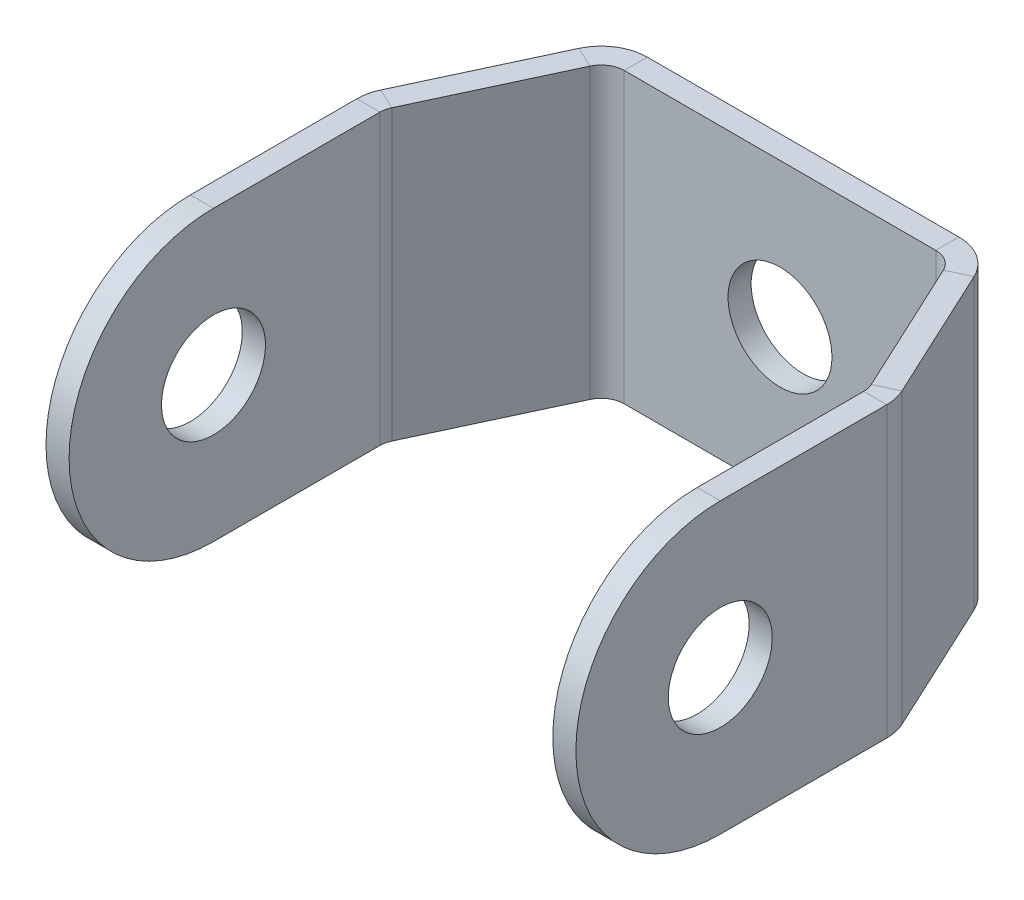
ISO-10303-21;
HEADER;
FILE_DESCRIPTION(('STEP AP214'),'2;1');
FILE_NAME('part.step','',(''),(''),'','','');
FILE_SCHEMA(('AUTOMOTIVE_DESIGN { 1 0 10303 214 1 1 1 1 }'));
ENDSEC;
DATA;
#1=APPLICATION_CONTEXT('core data for automotive mechanical design processes');
#2=APPLICATION_PROTOCOL_DEFINITION('international standard','automotive_design',2000,#1);
#3=PRODUCT_CONTEXT('',#1,'mechanical');
#4=PRODUCT('Part','Part','',(#3));
#5=PRODUCT_RELATED_PRODUCT_CATEGORY('part','',(#4));
#6=PRODUCT_DEFINITION_FORMATION('','',#4);
#7=PRODUCT_DEFINITION_CONTEXT('part definition',#1,'design');
#8=PRODUCT_DEFINITION('design','',#6,#7);
#9=PRODUCT_DEFINITION_SHAPE('','',#8);
#10=(LENGTH_UNIT() NAMED_UNIT(*) SI_UNIT(.MILLI.,.METRE.));
#11=(NAMED_UNIT(*) PLANE_ANGLE_UNIT() SI_UNIT($,.RADIAN.));
#12=(NAMED_UNIT(*) SI_UNIT($,.STERADIAN.) SOLID_ANGLE_UNIT());
#13=UNCERTAINTY_MEASURE_WITH_UNIT(LENGTH_MEASURE(1.E-05),#10,'distance_accuracy_value','');
#14=(GEOMETRIC_REPRESENTATION_CONTEXT(3) GLOBAL_UNCERTAINTY_ASSIGNED_CONTEXT((#13)) GLOBAL_UNIT_ASSIGNED_CONTEXT((#10,
#11,#12)) REPRESENTATION_CONTEXT('',''));
#15=CARTESIAN_POINT('',(0.,0.,0.));
#16=DIRECTION('',(0.,0.,1.));
#17=DIRECTION('',(1.,0.,0.));
#18=AXIS2_PLACEMENT_3D('',#15,#16,#17);
#19=CARTESIAN_POINT('',(-20.9421250605527,0.,30.1152937835399));
#20=DIRECTION('',(-1.,0.,0.));
#21=DIRECTION('',(0.,0.,1.));
#22=AXIS2_PLACEMENT_3D('',#19,#20,#21);
#23=CYLINDRICAL_SURFACE('',#22,12.5);
#24=CARTESIAN_POINT('',(-22.9421250605527,0.,30.1152937835399));
#25=DIRECTION('',(1.,0.,0.));
#26=DIRECTION('',(0.,0.,-1.));
#27=AXIS2_PLACEMENT_3D('',#24,#25,#26);
#28=CIRCLE('',#27,12.5);
#29=CARTESIAN_POINT('',(-22.9421250605527,12.5,30.1152937835399));
#30=VERTEX_POINT('',#29);
#31=CARTESIAN_POINT('',(-22.9421250605527,-12.5,30.1152937835399));
#32=VERTEX_POINT('',#31);
#33=EDGE_CURVE('E76',#30,#32,#28,.T.);
#34=ORIENTED_EDGE('',*,*,#33,.T.);
#35=DIRECTION('',(-1.,0.,0.));
#36=VECTOR('',#35,1.);
#37=CARTESIAN_POINT('',(-20.9421250605527,-12.5,30.1152937835399));
#38=LINE('',#37,#36);
#39=CARTESIAN_POINT('',(-20.9421250605527,-12.5,30.1152937835399));
#40=VERTEX_POINT('',#39);
#41=EDGE_CURVE('E288',#40,#32,#38,.T.);
#42=ORIENTED_EDGE('',*,*,#41,.F.);
#43=CARTESIAN_POINT('',(-20.9421250605527,0.,30.1152937835399));
#44=DIRECTION('',(1.,0.,0.));
#45=DIRECTION('',(0.,0.,-1.));
#46=AXIS2_PLACEMENT_3D('',#43,#44,#45);
#47=CIRCLE('',#46,12.5);
#48=CARTESIAN_POINT('',(-20.9421250605527,12.5,30.1152937835399));
#49=VERTEX_POINT('',#48);
#50=EDGE_CURVE('E282',#49,#40,#47,.T.);
#51=ORIENTED_EDGE('',*,*,#50,.F.);
#52=DIRECTION('',(-1.,0.,0.));
#53=VECTOR('',#52,1.);
#54=CARTESIAN_POINT('',(-20.9421250605527,12.5,30.1152937835399));
#55=LINE('',#54,#53);
#56=EDGE_CURVE('E297',#49,#30,#55,.T.);
#57=ORIENTED_EDGE('',*,*,#56,.T.);
#58=EDGE_LOOP('',(#34,#42,#51,#57));
#59=FACE_BOUND('',#58,.T.);
#60=ADVANCED_FACE('F39',(#59),#23,.T.);
#61=CARTESIAN_POINT('',(-20.9421250605527,0.,30.1152937835399));
#62=DIRECTION('',(-1.,0.,0.));
#63=DIRECTION('',(0.,0.,1.));
#64=AXIS2_PLACEMENT_3D('',#61,#62,#63);
#65=CYLINDRICAL_SURFACE('',#64,4.5);
#66=CARTESIAN_POINT('',(-20.9421250605527,0.,30.1152937835399));
#67=DIRECTION('',(1.,0.,0.));
#68=DIRECTION('',(0.,0.,1.));
#69=AXIS2_PLACEMENT_3D('',#66,#67,#68);
#70=CIRCLE('',#69,4.5);
#71=CARTESIAN_POINT('',(-20.9421250605527,0.,34.6152937835399));
#72=VERTEX_POINT('',#71);
#73=EDGE_CURVE('E294',#72,#72,#70,.T.);
#74=ORIENTED_EDGE('',*,*,#73,.T.);
#75=EDGE_LOOP('',(#74));
#76=FACE_BOUND('',#75,.T.);
#77=CARTESIAN_POINT('',(-22.9421250605527,0.,30.1152937835399));
#78=DIRECTION('',(1.,0.,0.));
#79=DIRECTION('',(0.,0.,1.));
#80=AXIS2_PLACEMENT_3D('',#77,#78,#79);
#81=CIRCLE('',#80,4.5);
#82=CARTESIAN_POINT('',(-22.9421250605527,0.,34.6152937835399));
#83=VERTEX_POINT('',#82);
#84=EDGE_CURVE('E291',#83,#83,#81,.T.);
#85=ORIENTED_EDGE('',*,*,#84,.F.);
#86=EDGE_LOOP('',(#85));
#87=FACE_BOUND('',#86,.T.);
#88=ADVANCED_FACE('F493',(#76,#87),#65,.F.);
#89=CARTESIAN_POINT('',(-22.942125060553,0.,-59.8847062164601));
#90=DIRECTION('',(-1.,0.,0.));
#91=DIRECTION('',(0.,0.,1.));
#92=AXIS2_PLACEMENT_3D('',#89,#90,#91);
#93=PLANE('',#92);
#94=ORIENTED_EDGE('',*,*,#84,.T.);
#95=EDGE_LOOP('',(#94));
#96=FACE_BOUND('',#95,.T.);
#97=DIRECTION('',(0.,0.,1.));
#98=VECTOR('',#97,1.);
#99=CARTESIAN_POINT('',(-22.9421250605527,12.5,30.1152937835399));
#100=LINE('',#99,#98);
#101=CARTESIAN_POINT('',(-22.9421250605527,12.5,15.696924756767));
#102=VERTEX_POINT('',#101);
#103=EDGE_CURVE('E11',#102,#30,#100,.T.);
#104=ORIENTED_EDGE('',*,*,#103,.F.);
#105=DIRECTION('',(0.,-1.,0.));
#106=VECTOR('',#105,1.);
#107=CARTESIAN_POINT('',(-22.9421250605527,0.,15.696924756767));
#108=LINE('',#107,#106);
#109=CARTESIAN_POINT('',(-22.9421250605527,-12.5,15.696924756767));
#110=VERTEX_POINT('',#109);
#111=EDGE_CURVE('E257',#102,#110,#108,.T.);
#112=ORIENTED_EDGE('',*,*,#111,.T.);
#113=DIRECTION('',(0.,0.,-1.));
#114=VECTOR('',#113,1.);
#115=CARTESIAN_POINT('',(-22.9421250605527,-12.5,30.1152937835399));
#116=LINE('',#115,#114);
#117=EDGE_CURVE('E286',#32,#110,#116,.T.);
#118=ORIENTED_EDGE('',*,*,#117,.F.);
#119=ORIENTED_EDGE('',*,*,#33,.F.);
#120=EDGE_LOOP('',(#104,#112,#118,#119));
#121=FACE_BOUND('',#120,.T.);
#122=ADVANCED_FACE('F498',(#96,#121),#93,.T.);
#123=CARTESIAN_POINT('',(-20.9421250605527,-12.5,30.1152937835399));
#124=DIRECTION('',(0.,1.,0.));
#125=DIRECTION('',(1.,0.,0.));
#126=AXIS2_PLACEMENT_3D('',#123,#124,#125);
#127=PLANE('',#126);
#128=DIRECTION('',(-1.,0.,0.));
#129=VECTOR('',#128,1.);
#130=CARTESIAN_POINT('',(-20.9421250605527,-12.5,15.696924756767));
#131=LINE('',#130,#129);
#132=CARTESIAN_POINT('',(-20.9421250605527,-12.5,15.696924756767));
#133=VERTEX_POINT('',#132);
#134=EDGE_CURVE('E300',#133,#110,#131,.T.);
#135=ORIENTED_EDGE('',*,*,#134,.F.);
#136=DIRECTION('',(0.,0.,-1.));
#137=VECTOR('',#136,1.);
#138=CARTESIAN_POINT('',(-20.9421250605527,-12.5,30.1152937835399));
#139=LINE('',#138,#137);
#140=EDGE_CURVE('E49',#40,#133,#139,.T.);
#141=ORIENTED_EDGE('',*,*,#140,.F.);
#142=ORIENTED_EDGE('',*,*,#41,.T.);
#143=ORIENTED_EDGE('',*,*,#117,.T.);
#144=EDGE_LOOP('',(#135,#141,#142,#143));
#145=FACE_BOUND('',#144,.T.);
#146=ADVANCED_FACE('F506',(#145),#127,.F.);
#147=CARTESIAN_POINT('',(-20.942125060553,0.,-59.8847062164601));
#148=DIRECTION('',(-1.,0.,0.));
#149=DIRECTION('',(0.,0.,1.));
#150=AXIS2_PLACEMENT_3D('',#147,#148,#149);
#151=PLANE('',#150);
#152=DIRECTION('',(0.,-1.,0.));
#153=VECTOR('',#152,1.);
#154=CARTESIAN_POINT('',(-20.9421250605527,0.,15.696924756767));
#155=LINE('',#154,#153);
#156=CARTESIAN_POINT('',(-20.9421250605527,12.5,15.696924756767));
#157=VERTEX_POINT('',#156);
#158=EDGE_CURVE('E83',#157,#133,#155,.T.);
#159=ORIENTED_EDGE('',*,*,#158,.F.);
#160=DIRECTION('',(0.,0.,1.));
#161=VECTOR('',#160,1.);
#162=CARTESIAN_POINT('',(-20.9421250605527,12.5,30.1152937835399));
#163=LINE('',#162,#161);
#164=EDGE_CURVE('E284',#157,#49,#163,.T.);
#165=ORIENTED_EDGE('',*,*,#164,.T.);
#166=ORIENTED_EDGE('',*,*,#50,.T.);
#167=ORIENTED_EDGE('',*,*,#140,.T.);
#168=EDGE_LOOP('',(#159,#165,#166,#167));
#169=FACE_BOUND('',#168,.T.);
#170=ORIENTED_EDGE('',*,*,#73,.F.);
#171=EDGE_LOOP('',(#170));
#172=FACE_BOUND('',#171,.T.);
#173=ADVANCED_FACE('F509',(#169,#172),#151,.F.);
#174=CARTESIAN_POINT('',(-20.9421250605527,12.5,30.1152937835399));
#175=DIRECTION('',(0.,-1.,0.));
#176=DIRECTION('',(-1.,0.,0.));
#177=AXIS2_PLACEMENT_3D('',#174,#175,#176);
#178=PLANE('',#177);
#179=DIRECTION('',(1.,0.,0.));
#180=VECTOR('',#179,1.);
#181=CARTESIAN_POINT('',(-20.9421250605527,12.5,15.696924756767));
#182=LINE('',#181,#180);
#183=EDGE_CURVE('E43',#102,#157,#182,.T.);
#184=ORIENTED_EDGE('',*,*,#183,.F.);
#185=ORIENTED_EDGE('',*,*,#103,.T.);
#186=ORIENTED_EDGE('',*,*,#56,.F.);
#187=ORIENTED_EDGE('',*,*,#164,.F.);
#188=EDGE_LOOP('',(#184,#185,#186,#187));
#189=FACE_BOUND('',#188,.T.);
#190=ADVANCED_FACE('F41',(#189),#178,.F.);
#191=CARTESIAN_POINT('',(20.9421250605527,0.,30.1152937835399));
#192=DIRECTION('',(1.,0.,0.));
#193=DIRECTION('',(0.,0.,-1.));
#194=AXIS2_PLACEMENT_3D('',#191,#192,#193);
#195=CYLINDRICAL_SURFACE('',#194,12.5);
#196=CARTESIAN_POINT('',(22.9421250605527,0.,30.1152937835399));
#197=DIRECTION('',(-1.,0.,0.));
#198=DIRECTION('',(0.,0.,-1.));
#199=AXIS2_PLACEMENT_3D('',#196,#197,#198);
#200=CIRCLE('',#199,12.5);
#201=CARTESIAN_POINT('',(22.9421250605527,-12.5,30.1152937835399));
#202=VERTEX_POINT('',#201);
#203=CARTESIAN_POINT('',(22.9421250605527,12.5,30.1152937835399));
#204=VERTEX_POINT('',#203);
#205=EDGE_CURVE('E330',#202,#204,#200,.T.);
#206=ORIENTED_EDGE('',*,*,#205,.T.);
#207=DIRECTION('',(1.,0.,0.));
#208=VECTOR('',#207,1.);
#209=CARTESIAN_POINT('',(20.9421250605527,12.5,30.1152937835399));
#210=LINE('',#209,#208);
#211=CARTESIAN_POINT('',(20.9421250605527,12.5,30.1152937835399));
#212=VERTEX_POINT('',#211);
#213=EDGE_CURVE('E318',#212,#204,#210,.T.);
#214=ORIENTED_EDGE('',*,*,#213,.F.);
#215=CARTESIAN_POINT('',(20.9421250605527,0.,30.1152937835399));
#216=DIRECTION('',(-1.,0.,0.));
#217=DIRECTION('',(0.,0.,-1.));
#218=AXIS2_PLACEMENT_3D('',#215,#216,#217);
#219=CIRCLE('',#218,12.5);
#220=CARTESIAN_POINT('',(20.9421250605527,-12.5,30.1152937835399));
#221=VERTEX_POINT('',#220);
#222=EDGE_CURVE('E307',#221,#212,#219,.T.);
#223=ORIENTED_EDGE('',*,*,#222,.F.);
#224=DIRECTION('',(1.,0.,0.));
#225=VECTOR('',#224,1.);
#226=CARTESIAN_POINT('',(20.9421250605527,-12.5,30.1152937835399));
#227=LINE('',#226,#225);
#228=EDGE_CURVE('E328',#221,#202,#227,.T.);
#229=ORIENTED_EDGE('',*,*,#228,.T.);
#230=EDGE_LOOP('',(#206,#214,#223,#229));
#231=FACE_BOUND('',#230,.T.);
#232=ADVANCED_FACE('F515',(#231),#195,.T.);
#233=CARTESIAN_POINT('',(20.9421250605527,0.,30.1152937835399));
#234=DIRECTION('',(1.,0.,0.));
#235=DIRECTION('',(0.,0.,-1.));
#236=AXIS2_PLACEMENT_3D('',#233,#234,#235);
#237=CYLINDRICAL_SURFACE('',#236,4.5);
#238=CARTESIAN_POINT('',(20.9421250605527,0.,30.1152937835399));
#239=DIRECTION('',(-1.,0.,0.));
#240=DIRECTION('',(0.,0.,1.));
#241=AXIS2_PLACEMENT_3D('',#238,#239,#240);
#242=CIRCLE('',#241,4.5);
#243=CARTESIAN_POINT('',(20.9421250605527,0.,34.6152937835399));
#244=VERTEX_POINT('',#243);
#245=EDGE_CURVE('E325',#244,#244,#242,.T.);
#246=ORIENTED_EDGE('',*,*,#245,.T.);
#247=EDGE_LOOP('',(#246));
#248=FACE_BOUND('',#247,.T.);
#249=CARTESIAN_POINT('',(22.9421250605527,0.,30.1152937835399));
#250=DIRECTION('',(-1.,0.,0.));
#251=DIRECTION('',(0.,0.,1.));
#252=AXIS2_PLACEMENT_3D('',#249,#250,#251);
#253=CIRCLE('',#252,4.5);
#254=CARTESIAN_POINT('',(22.9421250605527,0.,34.6152937835399));
#255=VERTEX_POINT('',#254);
#256=EDGE_CURVE('E322',#255,#255,#253,.T.);
#257=ORIENTED_EDGE('',*,*,#256,.F.);
#258=EDGE_LOOP('',(#257));
#259=FACE_BOUND('',#258,.T.);
#260=ADVANCED_FACE('F554',(#248,#259),#237,.F.);
#261=CARTESIAN_POINT('',(22.9421250605527,0.,30.1152937835399));
#262=DIRECTION('',(1.,0.,0.));
#263=DIRECTION('',(0.,0.,-1.));
#264=AXIS2_PLACEMENT_3D('',#261,#262,#263);
#265=PLANE('',#264);
#266=ORIENTED_EDGE('',*,*,#256,.T.);
#267=EDGE_LOOP('',(#266));
#268=FACE_BOUND('',#267,.T.);
#269=DIRECTION('',(0.,0.,1.));
#270=VECTOR('',#269,1.);
#271=CARTESIAN_POINT('',(22.942125060553,-12.5,-59.8847062164601));
#272=LINE('',#271,#270);
#273=CARTESIAN_POINT('',(22.9421250605527,-12.5,15.696924756767));
#274=VERTEX_POINT('',#273);
#275=EDGE_CURVE('E92',#274,#202,#272,.T.);
#276=ORIENTED_EDGE('',*,*,#275,.F.);
#277=DIRECTION('',(0.,1.,0.));
#278=VECTOR('',#277,1.);
#279=CARTESIAN_POINT('',(22.9421250605527,0.,15.696924756767));
#280=LINE('',#279,#278);
#281=CARTESIAN_POINT('',(22.9421250605527,12.5,15.696924756767));
#282=VERTEX_POINT('',#281);
#283=EDGE_CURVE('E320',#274,#282,#280,.T.);
#284=ORIENTED_EDGE('',*,*,#283,.T.);
#285=DIRECTION('',(0.,0.,-1.));
#286=VECTOR('',#285,1.);
#287=CARTESIAN_POINT('',(22.942125060553,12.5,-59.8847062164601));
#288=LINE('',#287,#286);
#289=EDGE_CURVE('E113',#204,#282,#288,.T.);
#290=ORIENTED_EDGE('',*,*,#289,.F.);
#291=ORIENTED_EDGE('',*,*,#205,.F.);
#292=EDGE_LOOP('',(#276,#284,#290,#291));
#293=FACE_BOUND('',#292,.T.);
#294=ADVANCED_FACE('F550',(#268,#293),#265,.T.);
#295=CARTESIAN_POINT('',(20.942125060553,12.5,-59.8847062164601));
#296=DIRECTION('',(0.,-1.,0.));
#297=DIRECTION('',(1.,0.,0.));
#298=AXIS2_PLACEMENT_3D('',#295,#296,#297);
#299=PLANE('',#298);
#300=DIRECTION('',(1.,0.,0.));
#301=VECTOR('',#300,1.);
#302=CARTESIAN_POINT('',(20.9421250605527,12.5,15.696924756767));
#303=LINE('',#302,#301);
#304=CARTESIAN_POINT('',(20.9421250605527,12.5,15.696924756767));
#305=VERTEX_POINT('',#304);
#306=EDGE_CURVE('E333',#305,#282,#303,.T.);
#307=ORIENTED_EDGE('',*,*,#306,.F.);
#308=DIRECTION('',(0.,0.,-1.));
#309=VECTOR('',#308,1.);
#310=CARTESIAN_POINT('',(20.942125060553,12.5,-59.8847062164601));
#311=LINE('',#310,#309);
#312=EDGE_CURVE('E305',#212,#305,#311,.T.);
#313=ORIENTED_EDGE('',*,*,#312,.F.);
#314=ORIENTED_EDGE('',*,*,#213,.T.);
#315=ORIENTED_EDGE('',*,*,#289,.T.);
#316=EDGE_LOOP('',(#307,#313,#314,#315));
#317=FACE_BOUND('',#316,.T.);
#318=ADVANCED_FACE('F547',(#317),#299,.F.);
#319=CARTESIAN_POINT('',(20.9421250605527,0.,30.1152937835399));
#320=DIRECTION('',(1.,0.,0.));
#321=DIRECTION('',(0.,0.,-1.));
#322=AXIS2_PLACEMENT_3D('',#319,#320,#321);
#323=PLANE('',#322);
#324=DIRECTION('',(0.,1.,0.));
#325=VECTOR('',#324,1.);
#326=CARTESIAN_POINT('',(20.9421250605527,0.,15.696924756767));
#327=LINE('',#326,#325);
#328=CARTESIAN_POINT('',(20.9421250605527,-12.5,15.696924756767));
#329=VERTEX_POINT('',#328);
#330=EDGE_CURVE('E120',#329,#305,#327,.T.);
#331=ORIENTED_EDGE('',*,*,#330,.F.);
#332=DIRECTION('',(0.,0.,1.));
#333=VECTOR('',#332,1.);
#334=CARTESIAN_POINT('',(20.942125060553,-12.5,-59.8847062164601));
#335=LINE('',#334,#333);
#336=EDGE_CURVE('E315',#329,#221,#335,.T.);
#337=ORIENTED_EDGE('',*,*,#336,.T.);
#338=ORIENTED_EDGE('',*,*,#222,.T.);
#339=ORIENTED_EDGE('',*,*,#312,.T.);
#340=EDGE_LOOP('',(#331,#337,#338,#339));
#341=FACE_BOUND('',#340,.T.);
#342=ORIENTED_EDGE('',*,*,#245,.F.);
#343=EDGE_LOOP('',(#342));
#344=FACE_BOUND('',#343,.T.);
#345=ADVANCED_FACE('F544',(#341,#344),#323,.F.);
#346=CARTESIAN_POINT('',(20.942125060553,-12.5,-59.8847062164601));
#347=DIRECTION('',(0.,1.,0.));
#348=DIRECTION('',(-1.,0.,0.));
#349=AXIS2_PLACEMENT_3D('',#346,#347,#348);
#350=PLANE('',#349);
#351=DIRECTION('',(-1.,0.,0.));
#352=VECTOR('',#351,1.);
#353=CARTESIAN_POINT('',(20.9421250605527,-12.5,15.696924756767));
#354=LINE('',#353,#352);
#355=EDGE_CURVE('E245',#274,#329,#354,.T.);
#356=ORIENTED_EDGE('',*,*,#355,.F.);
#357=ORIENTED_EDGE('',*,*,#275,.T.);
#358=ORIENTED_EDGE('',*,*,#228,.F.);
#359=ORIENTED_EDGE('',*,*,#336,.F.);
#360=EDGE_LOOP('',(#356,#357,#358,#359));
#361=FACE_BOUND('',#360,.T.);
#362=ADVANCED_FACE('F539',(#361),#350,.F.);
#363=CARTESIAN_POINT('',(8.88320555097317,0.,-53.4394956377272));
#364=DIRECTION('',(-0.906307787036651,0.,-0.422618261740697));
#365=DIRECTION('',(-0.422618261740697,0.,0.906307787036651));
#366=AXIS2_PLACEMENT_3D('',#363,#364,#365);
#367=PLANE('',#366);
#368=DIRECTION('',(0.,-1.,0.));
#369=VECTOR('',#368,1.);
#370=CARTESIAN_POINT('',(-22.5673562086993,0.,14.0064517098042));
#371=LINE('',#370,#369);
#372=CARTESIAN_POINT('',(-22.5673562086993,12.5,14.0064517098042));
#373=VERTEX_POINT('',#372);
#374=CARTESIAN_POINT('',(-22.5673562086993,-12.5,14.0064517098042));
#375=VERTEX_POINT('',#374);
#376=EDGE_CURVE('E254',#373,#375,#371,.T.);
#377=ORIENTED_EDGE('',*,*,#376,.F.);
#378=DIRECTION('',(-0.422618261740697,0.,0.906307787036651));
#379=VECTOR('',#378,1.);
#380=CARTESIAN_POINT('',(-29.1524380056896,12.5,28.1282051955714));
#381=LINE('',#380,#379);
#382=CARTESIAN_POINT('',(-17.1129906177561,12.5,2.30952695303721));
#383=VERTEX_POINT('',#382);
#384=EDGE_CURVE('E246',#383,#373,#381,.T.);
#385=ORIENTED_EDGE('',*,*,#384,.F.);
#386=DIRECTION('',(0.,-1.,0.));
#387=VECTOR('',#386,1.);
#388=CARTESIAN_POINT('',(-17.1129906177561,0.,2.30952695303721));
#389=LINE('',#388,#387);
#390=CARTESIAN_POINT('',(-17.1129906177561,-12.5,2.30952695303722));
#391=VERTEX_POINT('',#390);
#392=EDGE_CURVE('E267',#383,#391,#389,.T.);
#393=ORIENTED_EDGE('',*,*,#392,.T.);
#394=DIRECTION('',(0.422618261740697,0.,-0.906307787036651));
#395=VECTOR('',#394,1.);
#396=CARTESIAN_POINT('',(-29.1524380056896,-12.5,28.1282051955714));
#397=LINE('',#396,#395);
#398=EDGE_CURVE('E266',#375,#391,#397,.T.);
#399=ORIENTED_EDGE('',*,*,#398,.F.);
#400=EDGE_LOOP('',(#377,#385,#393,#399));
#401=FACE_BOUND('',#400,.T.);
#402=ADVANCED_FACE('F263',(#401),#367,.T.);
#403=CARTESIAN_POINT('',(-27.3398224316163,-12.5,28.9734417190528));
#404=DIRECTION('',(0.,1.,0.));
#405=DIRECTION('',(0.906307787036651,0.,0.422618261740697));
#406=AXIS2_PLACEMENT_3D('',#403,#404,#405);
#407=PLANE('',#406);
#408=DIRECTION('',(0.422618261740697,0.,-0.906307787036651));
#409=VECTOR('',#408,1.);
#410=CARTESIAN_POINT('',(-27.3398224316163,-12.5,28.9734417190528));
#411=LINE('',#410,#409);
#412=CARTESIAN_POINT('',(-20.754740634626,-12.5,14.8516882332856));
#413=VERTEX_POINT('',#412);
#414=CARTESIAN_POINT('',(-15.3003750436828,-12.5,3.15476347651861));
#415=VERTEX_POINT('',#414);
#416=EDGE_CURVE('E129',#413,#415,#411,.T.);
#417=ORIENTED_EDGE('',*,*,#416,.F.);
#418=DIRECTION('',(-0.906307787036651,0.,-0.422618261740697));
#419=VECTOR('',#418,1.);
#420=CARTESIAN_POINT('',(-20.754740634626,-12.5,14.8516882332856));
#421=LINE('',#420,#419);
#422=EDGE_CURVE('E279',#413,#375,#421,.T.);
#423=ORIENTED_EDGE('',*,*,#422,.T.);
#424=ORIENTED_EDGE('',*,*,#398,.T.);
#425=DIRECTION('',(-0.906307787036651,0.,-0.422618261740697));
#426=VECTOR('',#425,1.);
#427=CARTESIAN_POINT('',(-15.3003750436828,-12.5,3.15476347651861));
#428=LINE('',#427,#426);
#429=EDGE_CURVE('E268',#415,#391,#428,.T.);
#430=ORIENTED_EDGE('',*,*,#429,.F.);
#431=EDGE_LOOP('',(#417,#423,#424,#430));
#432=FACE_BOUND('',#431,.T.);
#433=ADVANCED_FACE('F532',(#432),#407,.F.);
#434=CARTESIAN_POINT('',(10.6958211250465,0.,-52.5942591142458));
#435=DIRECTION('',(-0.906307787036651,0.,-0.422618261740697));
#436=DIRECTION('',(-0.422618261740697,0.,0.906307787036651));
#437=AXIS2_PLACEMENT_3D('',#434,#435,#436);
#438=PLANE('',#437);
#439=DIRECTION('',(-0.422618261740697,0.,0.906307787036651));
#440=VECTOR('',#439,1.);
#441=CARTESIAN_POINT('',(-27.3398224316163,12.5,28.9734417190528));
#442=LINE('',#441,#440);
#443=CARTESIAN_POINT('',(-15.3003750436828,12.5,3.15476347651861));
#444=VERTEX_POINT('',#443);
#445=CARTESIAN_POINT('',(-20.754740634626,12.5,14.8516882332856));
#446=VERTEX_POINT('',#445);
#447=EDGE_CURVE('E277',#444,#446,#442,.T.);
#448=ORIENTED_EDGE('',*,*,#447,.T.);
#449=DIRECTION('',(0.,-1.,0.));
#450=VECTOR('',#449,1.);
#451=CARTESIAN_POINT('',(-20.754740634626,0.,14.8516882332856));
#452=LINE('',#451,#450);
#453=EDGE_CURVE('E272',#446,#413,#452,.T.);
#454=ORIENTED_EDGE('',*,*,#453,.T.);
#455=ORIENTED_EDGE('',*,*,#416,.T.);
#456=DIRECTION('',(0.,-1.,0.));
#457=VECTOR('',#456,1.);
#458=CARTESIAN_POINT('',(-15.3003750436828,0.,3.1547634765186));
#459=LINE('',#458,#457);
#460=EDGE_CURVE('E139',#444,#415,#459,.T.);
#461=ORIENTED_EDGE('',*,*,#460,.F.);
#462=EDGE_LOOP('',(#448,#454,#455,#461));
#463=FACE_BOUND('',#462,.T.);
#464=ADVANCED_FACE('F530',(#463),#438,.F.);
#465=CARTESIAN_POINT('',(-27.3398224316163,12.5,28.9734417190528));
#466=DIRECTION('',(0.,-1.,0.));
#467=DIRECTION('',(-0.906307787036651,0.,-0.422618261740697));
#468=AXIS2_PLACEMENT_3D('',#465,#466,#467);
#469=PLANE('',#468);
#470=ORIENTED_EDGE('',*,*,#384,.T.);
#471=DIRECTION('',(0.906307787036651,0.,0.422618261740697));
#472=VECTOR('',#471,1.);
#473=CARTESIAN_POINT('',(-20.754740634626,12.5,14.8516882332856));
#474=LINE('',#473,#472);
#475=EDGE_CURVE('E238',#373,#446,#474,.T.);
#476=ORIENTED_EDGE('',*,*,#475,.T.);
#477=ORIENTED_EDGE('',*,*,#447,.F.);
#478=DIRECTION('',(0.906307787036651,0.,0.422618261740697));
#479=VECTOR('',#478,1.);
#480=CARTESIAN_POINT('',(-15.3003750436828,12.5,3.15476347651861));
#481=LINE('',#480,#479);
#482=EDGE_CURVE('E146',#383,#444,#481,.T.);
#483=ORIENTED_EDGE('',*,*,#482,.F.);
#484=EDGE_LOOP('',(#470,#476,#477,#483));
#485=FACE_BOUND('',#484,.T.);
#486=ADVANCED_FACE('F270',(#485),#469,.F.);
#487=CARTESIAN_POINT('',(29.1524380056896,0.,28.1282051955714));
#488=DIRECTION('',(0.906307787036651,0.,-0.422618261740697));
#489=DIRECTION('',(-0.422618261740697,0.,-0.906307787036651));
#490=AXIS2_PLACEMENT_3D('',#487,#488,#489);
#491=PLANE('',#490);
#492=DIRECTION('',(0.,1.,0.));
#493=VECTOR('',#492,1.);
#494=CARTESIAN_POINT('',(22.5673562086993,0.,14.0064517098042));
#495=LINE('',#494,#493);
#496=CARTESIAN_POINT('',(22.5673562086993,-12.5,14.0064517098042));
#497=VERTEX_POINT('',#496);
#498=CARTESIAN_POINT('',(22.5673562086993,12.5,14.0064517098042));
#499=VERTEX_POINT('',#498);
#500=EDGE_CURVE('E417',#497,#499,#495,.T.);
#501=ORIENTED_EDGE('',*,*,#500,.F.);
#502=DIRECTION('',(0.422618261740697,0.,0.906307787036651));
#503=VECTOR('',#502,1.);
#504=CARTESIAN_POINT('',(-8.88320555097317,-12.5,-53.4394956377272));
#505=LINE('',#504,#503);
#506=CARTESIAN_POINT('',(17.1129906177561,-12.5,2.3095269530372));
#507=VERTEX_POINT('',#506);
#508=EDGE_CURVE('E408',#507,#497,#505,.T.);
#509=ORIENTED_EDGE('',*,*,#508,.F.);
#510=DIRECTION('',(0.,1.,0.));
#511=VECTOR('',#510,1.);
#512=CARTESIAN_POINT('',(17.1129906177561,0.,2.30952695303721));
#513=LINE('',#512,#511);
#514=CARTESIAN_POINT('',(17.1129906177561,12.5,2.30952695303719));
#515=VERTEX_POINT('',#514);
#516=EDGE_CURVE('E415',#507,#515,#513,.T.);
#517=ORIENTED_EDGE('',*,*,#516,.T.);
#518=DIRECTION('',(-0.422618261740697,0.,-0.906307787036651));
#519=VECTOR('',#518,1.);
#520=CARTESIAN_POINT('',(-8.88320555097317,12.5,-53.4394956377272));
#521=LINE('',#520,#519);
#522=EDGE_CURVE('E310',#499,#515,#521,.T.);
#523=ORIENTED_EDGE('',*,*,#522,.F.);
#524=EDGE_LOOP('',(#501,#509,#517,#523));
#525=FACE_BOUND('',#524,.T.);
#526=ADVANCED_FACE('F570',(#525),#491,.T.);
#527=CARTESIAN_POINT('',(-10.6958211250465,12.5,-52.5942591142458));
#528=DIRECTION('',(0.,-1.,0.));
#529=DIRECTION('',(0.906307787036651,0.,-0.422618261740697));
#530=AXIS2_PLACEMENT_3D('',#527,#528,#529);
#531=PLANE('',#530);
#532=DIRECTION('',(-0.422618261740697,0.,-0.906307787036651));
#533=VECTOR('',#532,1.);
#534=CARTESIAN_POINT('',(-10.6958211250465,12.5,-52.5942591142458));
#535=LINE('',#534,#533);
#536=CARTESIAN_POINT('',(20.754740634626,12.5,14.8516882332856));
#537=VERTEX_POINT('',#536);
#538=CARTESIAN_POINT('',(15.3003750436828,12.5,3.15476347651859));
#539=VERTEX_POINT('',#538);
#540=EDGE_CURVE('E410',#537,#539,#535,.T.);
#541=ORIENTED_EDGE('',*,*,#540,.F.);
#542=DIRECTION('',(0.906307787036651,0.,-0.422618261740697));
#543=VECTOR('',#542,1.);
#544=CARTESIAN_POINT('',(20.754740634626,12.5,14.8516882332856));
#545=LINE('',#544,#543);
#546=EDGE_CURVE('E412',#537,#499,#545,.T.);
#547=ORIENTED_EDGE('',*,*,#546,.T.);
#548=ORIENTED_EDGE('',*,*,#522,.T.);
#549=DIRECTION('',(0.906307787036651,0.,-0.422618261740697));
#550=VECTOR('',#549,1.);
#551=CARTESIAN_POINT('',(15.3003750436828,12.5,3.1547634765186));
#552=LINE('',#551,#550);
#553=EDGE_CURVE('E419',#539,#515,#552,.T.);
#554=ORIENTED_EDGE('',*,*,#553,.F.);
#555=EDGE_LOOP('',(#541,#547,#548,#554));
#556=FACE_BOUND('',#555,.T.);
#557=ADVANCED_FACE('F445',(#556),#531,.F.);
#558=CARTESIAN_POINT('',(27.3398224316163,0.,28.9734417190528));
#559=DIRECTION('',(0.906307787036651,0.,-0.422618261740697));
#560=DIRECTION('',(-0.422618261740697,0.,-0.906307787036651));
#561=AXIS2_PLACEMENT_3D('',#558,#559,#560);
#562=PLANE('',#561);
#563=DIRECTION('',(0.422618261740697,0.,0.906307787036651));
#564=VECTOR('',#563,1.);
#565=CARTESIAN_POINT('',(-10.6958211250465,-12.5,-52.5942591142458));
#566=LINE('',#565,#564);
#567=CARTESIAN_POINT('',(15.3003750436828,-12.5,3.15476347651859));
#568=VERTEX_POINT('',#567);
#569=CARTESIAN_POINT('',(20.754740634626,-12.5,14.8516882332856));
#570=VERTEX_POINT('',#569);
#571=EDGE_CURVE('E411',#568,#570,#566,.T.);
#572=ORIENTED_EDGE('',*,*,#571,.T.);
#573=DIRECTION('',(0.,1.,0.));
#574=VECTOR('',#573,1.);
#575=CARTESIAN_POINT('',(20.754740634626,0.,14.8516882332856));
#576=LINE('',#575,#574);
#577=EDGE_CURVE('E349',#570,#537,#576,.T.);
#578=ORIENTED_EDGE('',*,*,#577,.T.);
#579=ORIENTED_EDGE('',*,*,#540,.T.);
#580=DIRECTION('',(0.,1.,0.));
#581=VECTOR('',#580,1.);
#582=CARTESIAN_POINT('',(15.3003750436828,0.,3.15476347651861));
#583=LINE('',#582,#581);
#584=EDGE_CURVE('E174',#568,#539,#583,.T.);
#585=ORIENTED_EDGE('',*,*,#584,.F.);
#586=EDGE_LOOP('',(#572,#578,#579,#585));
#587=FACE_BOUND('',#586,.T.);
#588=ADVANCED_FACE('F565',(#587),#562,.F.);
#589=CARTESIAN_POINT('',(-10.6958211250465,-12.5,-52.5942591142458));
#590=DIRECTION('',(0.,1.,0.));
#591=DIRECTION('',(-0.906307787036651,0.,0.422618261740697));
#592=AXIS2_PLACEMENT_3D('',#589,#590,#591);
#593=PLANE('',#592);
#594=ORIENTED_EDGE('',*,*,#508,.T.);
#595=DIRECTION('',(-0.906307787036651,0.,0.422618261740697));
#596=VECTOR('',#595,1.);
#597=CARTESIAN_POINT('',(20.754740634626,-12.5,14.8516882332856));
#598=LINE('',#597,#596);
#599=EDGE_CURVE('E406',#497,#570,#598,.T.);
#600=ORIENTED_EDGE('',*,*,#599,.T.);
#601=ORIENTED_EDGE('',*,*,#571,.F.);
#602=DIRECTION('',(-0.906307787036651,0.,0.422618261740697));
#603=VECTOR('',#602,1.);
#604=CARTESIAN_POINT('',(15.3003750436828,-12.5,3.1547634765186));
#605=LINE('',#604,#603);
#606=EDGE_CURVE('E155',#507,#568,#605,.T.);
#607=ORIENTED_EDGE('',*,*,#606,.F.);
#608=EDGE_LOOP('',(#594,#600,#601,#607));
#609=FACE_BOUND('',#608,.T.);
#610=ADVANCED_FACE('F562',(#609),#593,.F.);
#611=CARTESIAN_POINT('',(45.,0.,2.));
#612=DIRECTION('',(0.,0.,-1.));
#613=DIRECTION('',(-1.,0.,0.));
#614=AXIS2_PLACEMENT_3D('',#611,#612,#613);
#615=PLANE('',#614);
#616=CARTESIAN_POINT('',(0.,0.,2.));
#617=DIRECTION('',(0.,0.,1.));
#618=DIRECTION('',(1.,0.,0.));
#619=AXIS2_PLACEMENT_3D('',#616,#617,#618);
#620=CIRCLE('',#619,4.5);
#621=CARTESIAN_POINT('',(4.5,0.,2.));
#622=VERTEX_POINT('',#621);
#623=EDGE_CURVE('E377',#622,#622,#620,.T.);
#624=ORIENTED_EDGE('',*,*,#623,.F.);
#625=EDGE_LOOP('',(#624));
#626=FACE_BOUND('',#625,.T.);
#627=DIRECTION('',(-1.,0.,0.));
#628=VECTOR('',#627,1.);
#629=CARTESIAN_POINT('',(-45.,12.5,2.));
#630=LINE('',#629,#628);
#631=CARTESIAN_POINT('',(13.4877594696095,12.5,2.));
#632=VERTEX_POINT('',#631);
#633=CARTESIAN_POINT('',(-13.4877594696095,12.5,2.));
#634=VERTEX_POINT('',#633);
#635=EDGE_CURVE('E428',#632,#634,#630,.T.);
#636=ORIENTED_EDGE('',*,*,#635,.T.);
#637=DIRECTION('',(0.,-1.,0.));
#638=VECTOR('',#637,1.);
#639=CARTESIAN_POINT('',(-13.4877594696095,0.,2.));
#640=LINE('',#639,#638);
#641=CARTESIAN_POINT('',(-13.4877594696095,-12.5,2.));
#642=VERTEX_POINT('',#641);
#643=EDGE_CURVE('E401',#634,#642,#640,.T.);
#644=ORIENTED_EDGE('',*,*,#643,.T.);
#645=DIRECTION('',(1.,0.,0.));
#646=VECTOR('',#645,1.);
#647=CARTESIAN_POINT('',(-45.,-12.5,2.));
#648=LINE('',#647,#646);
#649=CARTESIAN_POINT('',(13.4877594696095,-12.5,2.));
#650=VERTEX_POINT('',#649);
#651=EDGE_CURVE('E387',#642,#650,#648,.T.);
#652=ORIENTED_EDGE('',*,*,#651,.T.);
#653=DIRECTION('',(0.,1.,0.));
#654=VECTOR('',#653,1.);
#655=CARTESIAN_POINT('',(13.4877594696095,0.,2.));
#656=LINE('',#655,#654);
#657=EDGE_CURVE('E390',#650,#632,#656,.T.);
#658=ORIENTED_EDGE('',*,*,#657,.T.);
#659=EDGE_LOOP('',(#636,#644,#652,#658));
#660=FACE_BOUND('',#659,.T.);
#661=ADVANCED_FACE('F476',(#626,#660),#615,.F.);
#662=CARTESIAN_POINT('',(-45.,12.5,2.));
#663=DIRECTION('',(0.,-1.,0.));
#664=DIRECTION('',(0.,0.,-1.));
#665=AXIS2_PLACEMENT_3D('',#662,#663,#664);
#666=PLANE('',#665);
#667=DIRECTION('',(-1.,0.,0.));
#668=VECTOR('',#667,1.);
#669=CARTESIAN_POINT('',(-45.,12.5,0.));
#670=LINE('',#669,#668);
#671=CARTESIAN_POINT('',(13.4877594696095,12.5,0.));
#672=VERTEX_POINT('',#671);
#673=CARTESIAN_POINT('',(-13.4877594696095,12.5,0.));
#674=VERTEX_POINT('',#673);
#675=EDGE_CURVE('E380',#672,#674,#670,.T.);
#676=ORIENTED_EDGE('',*,*,#675,.T.);
#677=DIRECTION('',(0.,0.,1.));
#678=VECTOR('',#677,1.);
#679=CARTESIAN_POINT('',(-13.4877594696095,12.5,2.));
#680=LINE('',#679,#678);
#681=EDGE_CURVE('E398',#674,#634,#680,.T.);
#682=ORIENTED_EDGE('',*,*,#681,.T.);
#683=ORIENTED_EDGE('',*,*,#635,.F.);
#684=DIRECTION('',(0.,0.,-1.));
#685=VECTOR('',#684,1.);
#686=CARTESIAN_POINT('',(13.4877594696095,12.5,2.));
#687=LINE('',#686,#685);
#688=EDGE_CURVE('E386',#632,#672,#687,.T.);
#689=ORIENTED_EDGE('',*,*,#688,.T.);
#690=EDGE_LOOP('',(#676,#682,#683,#689));
#691=FACE_BOUND('',#690,.T.);
#692=ADVANCED_FACE('F460',(#691),#666,.F.);
#693=CARTESIAN_POINT('',(-45.,-12.5,2.));
#694=DIRECTION('',(0.,1.,0.));
#695=DIRECTION('',(0.,0.,1.));
#696=AXIS2_PLACEMENT_3D('',#693,#694,#695);
#697=PLANE('',#696);
#698=ORIENTED_EDGE('',*,*,#651,.F.);
#699=DIRECTION('',(0.,0.,-1.));
#700=VECTOR('',#699,1.);
#701=CARTESIAN_POINT('',(-13.4877594696095,-12.5,2.));
#702=LINE('',#701,#700);
#703=CARTESIAN_POINT('',(-13.4877594696095,-12.5,0.));
#704=VERTEX_POINT('',#703);
#705=EDGE_CURVE('E395',#642,#704,#702,.T.);
#706=ORIENTED_EDGE('',*,*,#705,.T.);
#707=DIRECTION('',(1.,0.,0.));
#708=VECTOR('',#707,1.);
#709=CARTESIAN_POINT('',(-45.,-12.5,0.));
#710=LINE('',#709,#708);
#711=CARTESIAN_POINT('',(13.4877594696095,-12.5,0.));
#712=VERTEX_POINT('',#711);
#713=EDGE_CURVE('E425',#704,#712,#710,.T.);
#714=ORIENTED_EDGE('',*,*,#713,.T.);
#715=DIRECTION('',(0.,0.,1.));
#716=VECTOR('',#715,1.);
#717=CARTESIAN_POINT('',(13.4877594696095,-12.5,2.));
#718=LINE('',#717,#716);
#719=EDGE_CURVE('E383',#712,#650,#718,.T.);
#720=ORIENTED_EDGE('',*,*,#719,.T.);
#721=EDGE_LOOP('',(#698,#706,#714,#720));
#722=FACE_BOUND('',#721,.T.);
#723=ADVANCED_FACE('F469',(#722),#697,.F.);
#724=CARTESIAN_POINT('',(45.,0.,0.));
#725=DIRECTION('',(0.,0.,-1.));
#726=DIRECTION('',(-1.,0.,0.));
#727=AXIS2_PLACEMENT_3D('',#724,#725,#726);
#728=PLANE('',#727);
#729=DIRECTION('',(0.,-1.,0.));
#730=VECTOR('',#729,1.);
#731=CARTESIAN_POINT('',(-13.4877594696095,0.,0.));
#732=LINE('',#731,#730);
#733=EDGE_CURVE('E404',#674,#704,#732,.T.);
#734=ORIENTED_EDGE('',*,*,#733,.F.);
#735=ORIENTED_EDGE('',*,*,#675,.F.);
#736=DIRECTION('',(0.,1.,0.));
#737=VECTOR('',#736,1.);
#738=CARTESIAN_POINT('',(13.4877594696095,0.,0.));
#739=LINE('',#738,#737);
#740=EDGE_CURVE('E393',#712,#672,#739,.T.);
#741=ORIENTED_EDGE('',*,*,#740,.F.);
#742=ORIENTED_EDGE('',*,*,#713,.F.);
#743=EDGE_LOOP('',(#734,#735,#741,#742));
#744=FACE_BOUND('',#743,.T.);
#745=CARTESIAN_POINT('',(0.,0.,0.));
#746=DIRECTION('',(0.,0.,1.));
#747=DIRECTION('',(1.,0.,0.));
#748=AXIS2_PLACEMENT_3D('',#745,#746,#747);
#749=CIRCLE('',#748,4.5);
#750=CARTESIAN_POINT('',(4.5,0.,0.));
#751=VERTEX_POINT('',#750);
#752=EDGE_CURVE('E368',#751,#751,#749,.T.);
#753=ORIENTED_EDGE('',*,*,#752,.T.);
#754=EDGE_LOOP('',(#753));
#755=FACE_BOUND('',#754,.T.);
#756=ADVANCED_FACE('F462',(#744,#755),#728,.T.);
#757=CARTESIAN_POINT('',(0.,0.,2.));
#758=DIRECTION('',(0.,0.,-1.));
#759=DIRECTION('',(-1.,0.,0.));
#760=AXIS2_PLACEMENT_3D('',#757,#758,#759);
#761=CYLINDRICAL_SURFACE('',#760,4.5);
#762=ORIENTED_EDGE('',*,*,#623,.T.);
#763=EDGE_LOOP('',(#762));
#764=FACE_BOUND('',#763,.T.);
#765=ORIENTED_EDGE('',*,*,#752,.F.);
#766=EDGE_LOOP('',(#765));
#767=FACE_BOUND('',#766,.T.);
#768=ADVANCED_FACE('F483',(#764,#767),#761,.F.);
#769=CARTESIAN_POINT('',(13.4877594696095,-12.5,4.));
#770=DIRECTION('',(0.,1.,0.));
#771=DIRECTION('',(0.,0.,1.));
#772=AXIS2_PLACEMENT_3D('',#769,#770,#771);
#773=PLANE('',#772);
#774=ORIENTED_EDGE('',*,*,#606,.T.);
#775=CARTESIAN_POINT('',(13.4877594696095,-12.5,4.));
#776=DIRECTION('',(0.,1.,0.));
#777=DIRECTION('',(0.,0.,1.));
#778=AXIS2_PLACEMENT_3D('',#775,#776,#777);
#779=CIRCLE('',#778,2.);
#780=EDGE_CURVE('E357',#650,#568,#779,.F.);
#781=ORIENTED_EDGE('',*,*,#780,.F.);
#782=ORIENTED_EDGE('',*,*,#719,.F.);
#783=CARTESIAN_POINT('',(13.4877594696095,-12.5,4.));
#784=DIRECTION('',(0.,1.,0.));
#785=DIRECTION('',(0.,0.,1.));
#786=AXIS2_PLACEMENT_3D('',#783,#784,#785);
#787=CIRCLE('',#786,4.);
#788=EDGE_CURVE('E369',#712,#507,#787,.F.);
#789=ORIENTED_EDGE('',*,*,#788,.T.);
#790=EDGE_LOOP('',(#774,#781,#782,#789));
#791=FACE_BOUND('',#790,.T.);
#792=ADVANCED_FACE('F481',(#791),#773,.F.);
#793=CARTESIAN_POINT('',(13.4877594696095,12.5,4.));
#794=DIRECTION('',(0.,-1.,0.));
#795=DIRECTION('',(0.,0.,-1.));
#796=AXIS2_PLACEMENT_3D('',#793,#794,#795);
#797=PLANE('',#796);
#798=ORIENTED_EDGE('',*,*,#688,.F.);
#799=CARTESIAN_POINT('',(13.4877594696095,12.5,4.));
#800=DIRECTION('',(0.,1.,0.));
#801=DIRECTION('',(0.,0.,1.));
#802=AXIS2_PLACEMENT_3D('',#799,#800,#801);
#803=CIRCLE('',#802,2.);
#804=EDGE_CURVE('E372',#539,#632,#803,.T.);
#805=ORIENTED_EDGE('',*,*,#804,.F.);
#806=ORIENTED_EDGE('',*,*,#553,.T.);
#807=CARTESIAN_POINT('',(13.4877594696095,12.5,4.));
#808=DIRECTION('',(0.,1.,0.));
#809=DIRECTION('',(0.,0.,1.));
#810=AXIS2_PLACEMENT_3D('',#807,#808,#809);
#811=CIRCLE('',#810,4.);
#812=EDGE_CURVE('E189',#515,#672,#811,.T.);
#813=ORIENTED_EDGE('',*,*,#812,.T.);
#814=EDGE_LOOP('',(#798,#805,#806,#813));
#815=FACE_BOUND('',#814,.T.);
#816=ADVANCED_FACE('F449',(#815),#797,.F.);
#817=CARTESIAN_POINT('',(13.4877594696095,-130.203016104091,4.));
#818=DIRECTION('',(0.,1.,0.));
#819=DIRECTION('',(0.,0.,1.));
#820=AXIS2_PLACEMENT_3D('',#817,#818,#819);
#821=CYLINDRICAL_SURFACE('',#820,4.);
#822=ORIENTED_EDGE('',*,*,#812,.F.);
#823=ORIENTED_EDGE('',*,*,#516,.F.);
#824=ORIENTED_EDGE('',*,*,#788,.F.);
#825=ORIENTED_EDGE('',*,*,#740,.T.);
#826=EDGE_LOOP('',(#822,#823,#824,#825));
#827=FACE_BOUND('',#826,.T.);
#828=ADVANCED_FACE('F452',(#827),#821,.T.);
#829=CARTESIAN_POINT('',(13.4877594696095,-130.203016104091,4.));
#830=DIRECTION('',(0.,1.,0.));
#831=DIRECTION('',(0.,0.,1.));
#832=AXIS2_PLACEMENT_3D('',#829,#830,#831);
#833=CYLINDRICAL_SURFACE('',#832,2.);
#834=ORIENTED_EDGE('',*,*,#804,.T.);
#835=ORIENTED_EDGE('',*,*,#657,.F.);
#836=ORIENTED_EDGE('',*,*,#780,.T.);
#837=ORIENTED_EDGE('',*,*,#584,.T.);
#838=EDGE_LOOP('',(#834,#835,#836,#837));
#839=FACE_BOUND('',#838,.T.);
#840=ADVANCED_FACE('F479',(#839),#833,.F.);
#841=CARTESIAN_POINT('',(-13.4877594696095,12.5,4.));
#842=DIRECTION('',(0.,-1.,0.));
#843=DIRECTION('',(0.,0.,-1.));
#844=AXIS2_PLACEMENT_3D('',#841,#842,#843);
#845=PLANE('',#844);
#846=ORIENTED_EDGE('',*,*,#482,.T.);
#847=CARTESIAN_POINT('',(-13.4877594696095,12.5,4.));
#848=DIRECTION('',(0.,-1.,0.));
#849=DIRECTION('',(0.,0.,-1.));
#850=AXIS2_PLACEMENT_3D('',#847,#848,#849);
#851=CIRCLE('',#850,2.);
#852=EDGE_CURVE('E364',#634,#444,#851,.F.);
#853=ORIENTED_EDGE('',*,*,#852,.F.);
#854=ORIENTED_EDGE('',*,*,#681,.F.);
#855=CARTESIAN_POINT('',(-13.4877594696095,12.5,4.));
#856=DIRECTION('',(0.,-1.,0.));
#857=DIRECTION('',(0.,0.,-1.));
#858=AXIS2_PLACEMENT_3D('',#855,#856,#857);
#859=CIRCLE('',#858,4.);
#860=EDGE_CURVE('E358',#674,#383,#859,.F.);
#861=ORIENTED_EDGE('',*,*,#860,.T.);
#862=EDGE_LOOP('',(#846,#853,#854,#861));
#863=FACE_BOUND('',#862,.T.);
#864=ADVANCED_FACE('F616',(#863),#845,.F.);
#865=CARTESIAN_POINT('',(-13.4877594696095,-12.5,4.));
#866=DIRECTION('',(0.,1.,0.));
#867=DIRECTION('',(0.,0.,1.));
#868=AXIS2_PLACEMENT_3D('',#865,#866,#867);
#869=PLANE('',#868);
#870=ORIENTED_EDGE('',*,*,#705,.F.);
#871=CARTESIAN_POINT('',(-13.4877594696095,-12.5,4.));
#872=DIRECTION('',(0.,-1.,0.));
#873=DIRECTION('',(0.,0.,-1.));
#874=AXIS2_PLACEMENT_3D('',#871,#872,#873);
#875=CIRCLE('',#874,2.);
#876=EDGE_CURVE('E361',#415,#642,#875,.T.);
#877=ORIENTED_EDGE('',*,*,#876,.F.);
#878=ORIENTED_EDGE('',*,*,#429,.T.);
#879=CARTESIAN_POINT('',(-13.4877594696095,-12.5,4.));
#880=DIRECTION('',(0.,-1.,0.));
#881=DIRECTION('',(0.,0.,-1.));
#882=AXIS2_PLACEMENT_3D('',#879,#880,#881);
#883=CIRCLE('',#882,4.);
#884=EDGE_CURVE('E181',#391,#704,#883,.T.);
#885=ORIENTED_EDGE('',*,*,#884,.T.);
#886=EDGE_LOOP('',(#870,#877,#878,#885));
#887=FACE_BOUND('',#886,.T.);
#888=ADVANCED_FACE('F471',(#887),#869,.F.);
#889=CARTESIAN_POINT('',(-13.4877594696095,115.947326218211,4.));
#890=DIRECTION('',(0.,-1.,0.));
#891=DIRECTION('',(0.,0.,-1.));
#892=AXIS2_PLACEMENT_3D('',#889,#890,#891);
#893=CYLINDRICAL_SURFACE('',#892,4.);
#894=ORIENTED_EDGE('',*,*,#884,.F.);
#895=ORIENTED_EDGE('',*,*,#392,.F.);
#896=ORIENTED_EDGE('',*,*,#860,.F.);
#897=ORIENTED_EDGE('',*,*,#733,.T.);
#898=EDGE_LOOP('',(#894,#895,#896,#897));
#899=FACE_BOUND('',#898,.T.);
#900=ADVANCED_FACE('F466',(#899),#893,.T.);
#901=CARTESIAN_POINT('',(-13.4877594696095,115.947326218211,4.));
#902=DIRECTION('',(0.,-1.,0.));
#903=DIRECTION('',(0.,0.,-1.));
#904=AXIS2_PLACEMENT_3D('',#901,#902,#903);
#905=CYLINDRICAL_SURFACE('',#904,2.);
#906=ORIENTED_EDGE('',*,*,#876,.T.);
#907=ORIENTED_EDGE('',*,*,#643,.F.);
#908=ORIENTED_EDGE('',*,*,#852,.T.);
#909=ORIENTED_EDGE('',*,*,#460,.T.);
#910=EDGE_LOOP('',(#906,#907,#908,#909));
#911=FACE_BOUND('',#910,.T.);
#912=ADVANCED_FACE('F473',(#911),#905,.F.);
#913=CARTESIAN_POINT('',(18.9421250605527,-12.5,15.696924756767));
#914=DIRECTION('',(0.,1.,0.));
#915=DIRECTION('',(0.,0.,1.));
#916=AXIS2_PLACEMENT_3D('',#913,#914,#915);
#917=PLANE('',#916);
#918=ORIENTED_EDGE('',*,*,#355,.T.);
#919=CARTESIAN_POINT('',(18.9421250605527,-12.5,15.696924756767));
#920=DIRECTION('',(0.,1.,0.));
#921=DIRECTION('',(0.,0.,1.));
#922=AXIS2_PLACEMENT_3D('',#919,#920,#921);
#923=CIRCLE('',#922,2.);
#924=EDGE_CURVE('E343',#570,#329,#923,.F.);
#925=ORIENTED_EDGE('',*,*,#924,.F.);
#926=ORIENTED_EDGE('',*,*,#599,.F.);
#927=CARTESIAN_POINT('',(18.9421250605527,-12.5,15.696924756767));
#928=DIRECTION('',(0.,1.,0.));
#929=DIRECTION('',(0.,0.,1.));
#930=AXIS2_PLACEMENT_3D('',#927,#928,#929);
#931=CIRCLE('',#930,4.);
#932=EDGE_CURVE('E346',#497,#274,#931,.F.);
#933=ORIENTED_EDGE('',*,*,#932,.T.);
#934=EDGE_LOOP('',(#918,#925,#926,#933));
#935=FACE_BOUND('',#934,.T.);
#936=ADVANCED_FACE('F342',(#935),#917,.F.);
#937=CARTESIAN_POINT('',(18.9421250605527,12.5,15.696924756767));
#938=DIRECTION('',(0.,-1.,0.));
#939=DIRECTION('',(0.,0.,-1.));
#940=AXIS2_PLACEMENT_3D('',#937,#938,#939);
#941=PLANE('',#940);
#942=ORIENTED_EDGE('',*,*,#546,.F.);
#943=CARTESIAN_POINT('',(18.9421250605527,12.5,15.696924756767));
#944=DIRECTION('',(0.,1.,0.));
#945=DIRECTION('',(0.,0.,1.));
#946=AXIS2_PLACEMENT_3D('',#943,#944,#945);
#947=CIRCLE('',#946,2.);
#948=EDGE_CURVE('E350',#305,#537,#947,.T.);
#949=ORIENTED_EDGE('',*,*,#948,.F.);
#950=ORIENTED_EDGE('',*,*,#306,.T.);
#951=CARTESIAN_POINT('',(18.9421250605527,12.5,15.696924756767));
#952=DIRECTION('',(0.,1.,0.));
#953=DIRECTION('',(0.,0.,1.));
#954=AXIS2_PLACEMENT_3D('',#951,#952,#953);
#955=CIRCLE('',#954,4.);
#956=EDGE_CURVE('E168',#282,#499,#955,.T.);
#957=ORIENTED_EDGE('',*,*,#956,.T.);
#958=EDGE_LOOP('',(#942,#949,#950,#957));
#959=FACE_BOUND('',#958,.T.);
#960=ADVANCED_FACE('F648',(#959),#941,.F.);
#961=CARTESIAN_POINT('',(18.9421250605527,-96.1205549458799,15.696924756767));
#962=DIRECTION('',(0.,1.,0.));
#963=DIRECTION('',(0.,0.,1.));
#964=AXIS2_PLACEMENT_3D('',#961,#962,#963);
#965=CYLINDRICAL_SURFACE('',#964,4.);
#966=ORIENTED_EDGE('',*,*,#956,.F.);
#967=ORIENTED_EDGE('',*,*,#283,.F.);
#968=ORIENTED_EDGE('',*,*,#932,.F.);
#969=ORIENTED_EDGE('',*,*,#500,.T.);
#970=EDGE_LOOP('',(#966,#967,#968,#969));
#971=FACE_BOUND('',#970,.T.);
#972=ADVANCED_FACE('F655',(#971),#965,.T.);
#973=CARTESIAN_POINT('',(18.9421250605527,-96.1205549458799,15.696924756767));
#974=DIRECTION('',(0.,1.,0.));
#975=DIRECTION('',(0.,0.,1.));
#976=AXIS2_PLACEMENT_3D('',#973,#974,#975);
#977=CYLINDRICAL_SURFACE('',#976,2.);
#978=ORIENTED_EDGE('',*,*,#948,.T.);
#979=ORIENTED_EDGE('',*,*,#577,.F.);
#980=ORIENTED_EDGE('',*,*,#924,.T.);
#981=ORIENTED_EDGE('',*,*,#330,.T.);
#982=EDGE_LOOP('',(#978,#979,#980,#981));
#983=FACE_BOUND('',#982,.T.);
#984=ADVANCED_FACE('F347',(#983),#977,.F.);
#985=CARTESIAN_POINT('',(-18.9421250605527,12.5,15.696924756767));
#986=DIRECTION('',(0.,-1.,0.));
#987=DIRECTION('',(0.,0.,-1.));
#988=AXIS2_PLACEMENT_3D('',#985,#986,#987);
#989=PLANE('',#988);
#990=ORIENTED_EDGE('',*,*,#183,.T.);
#991=CARTESIAN_POINT('',(-18.9421250605527,12.5,15.696924756767));
#992=DIRECTION('',(0.,-1.,0.));
#993=DIRECTION('',(0.,0.,-1.));
#994=AXIS2_PLACEMENT_3D('',#991,#992,#993);
#995=CIRCLE('',#994,2.);
#996=EDGE_CURVE('E244',#446,#157,#995,.F.);
#997=ORIENTED_EDGE('',*,*,#996,.F.);
#998=ORIENTED_EDGE('',*,*,#475,.F.);
#999=CARTESIAN_POINT('',(-18.9421250605527,12.5,15.696924756767));
#1000=DIRECTION('',(0.,-1.,0.));
#1001=DIRECTION('',(0.,0.,-1.));
#1002=AXIS2_PLACEMENT_3D('',#999,#1000,#1001);
#1003=CIRCLE('',#1002,4.);
#1004=EDGE_CURVE('E242',#373,#102,#1003,.F.);
#1005=ORIENTED_EDGE('',*,*,#1004,.T.);
#1006=EDGE_LOOP('',(#990,#997,#998,#1005));
#1007=FACE_BOUND('',#1006,.T.);
#1008=ADVANCED_FACE('F241',(#1007),#989,.F.);
#1009=CARTESIAN_POINT('',(-18.9421250605527,-12.5,15.696924756767));
#1010=DIRECTION('',(0.,1.,0.));
#1011=DIRECTION('',(0.,0.,1.));
#1012=AXIS2_PLACEMENT_3D('',#1009,#1010,#1011);
#1013=PLANE('',#1012);
#1014=ORIENTED_EDGE('',*,*,#422,.F.);
#1015=CARTESIAN_POINT('',(-18.9421250605527,-12.5,15.696924756767));
#1016=DIRECTION('',(0.,-1.,0.));
#1017=DIRECTION('',(0.,0.,-1.));
#1018=AXIS2_PLACEMENT_3D('',#1015,#1016,#1017);
#1019=CIRCLE('',#1018,2.);
#1020=EDGE_CURVE('E259',#133,#413,#1019,.T.);
#1021=ORIENTED_EDGE('',*,*,#1020,.F.);
#1022=ORIENTED_EDGE('',*,*,#134,.T.);
#1023=CARTESIAN_POINT('',(-18.9421250605527,-12.5,15.696924756767));
#1024=DIRECTION('',(0.,-1.,0.));
#1025=DIRECTION('',(0.,0.,-1.));
#1026=AXIS2_PLACEMENT_3D('',#1023,#1024,#1025);
#1027=CIRCLE('',#1026,4.);
#1028=EDGE_CURVE('E258',#110,#375,#1027,.T.);
#1029=ORIENTED_EDGE('',*,*,#1028,.T.);
#1030=EDGE_LOOP('',(#1014,#1021,#1022,#1029));
#1031=FACE_BOUND('',#1030,.T.);
#1032=ADVANCED_FACE('F525',(#1031),#1013,.F.);
#1033=CARTESIAN_POINT('',(-18.9421250605527,88.2180085946749,15.696924756767));
#1034=DIRECTION('',(0.,-1.,0.));
#1035=DIRECTION('',(0.,0.,-1.));
#1036=AXIS2_PLACEMENT_3D('',#1033,#1034,#1035);
#1037=CYLINDRICAL_SURFACE('',#1036,4.);
#1038=ORIENTED_EDGE('',*,*,#1028,.F.);
#1039=ORIENTED_EDGE('',*,*,#111,.F.);
#1040=ORIENTED_EDGE('',*,*,#1004,.F.);
#1041=ORIENTED_EDGE('',*,*,#376,.T.);
#1042=EDGE_LOOP('',(#1038,#1039,#1040,#1041));
#1043=FACE_BOUND('',#1042,.T.);
#1044=ADVANCED_FACE('F253',(#1043),#1037,.T.);
#1045=CARTESIAN_POINT('',(-18.9421250605527,88.2180085946749,15.696924756767));
#1046=DIRECTION('',(0.,-1.,0.));
#1047=DIRECTION('',(0.,0.,-1.));
#1048=AXIS2_PLACEMENT_3D('',#1045,#1046,#1047);
#1049=CYLINDRICAL_SURFACE('',#1048,2.);
#1050=ORIENTED_EDGE('',*,*,#1020,.T.);
#1051=ORIENTED_EDGE('',*,*,#453,.F.);
#1052=ORIENTED_EDGE('',*,*,#996,.T.);
#1053=ORIENTED_EDGE('',*,*,#158,.T.);
#1054=EDGE_LOOP('',(#1050,#1051,#1052,#1053));
#1055=FACE_BOUND('',#1054,.T.);
#1056=ADVANCED_FACE('F529',(#1055),#1049,.F.);
#1057=CLOSED_SHELL('',(#60,#88,#122,#146,#173,#190,#232,#260,#294,#318,#345,#362,#402,#433,#464,
#486,#526,#557,#588,#610,#661,#692,#723,#756,#768,#792,#816,#828,#840,#864,#888,#900,#912,#936,
#960,#972,#984,#1008,#1032,#1044,#1056));
#1058=MANIFOLD_SOLID_BREP('B2',#1057);
#1059=ADVANCED_BREP_SHAPE_REPRESENTATION('',(#18,#1058),#14);
#1060=SHAPE_DEFINITION_REPRESENTATION(#9,#1059);
ENDSEC;
END-ISO-10303-21;
